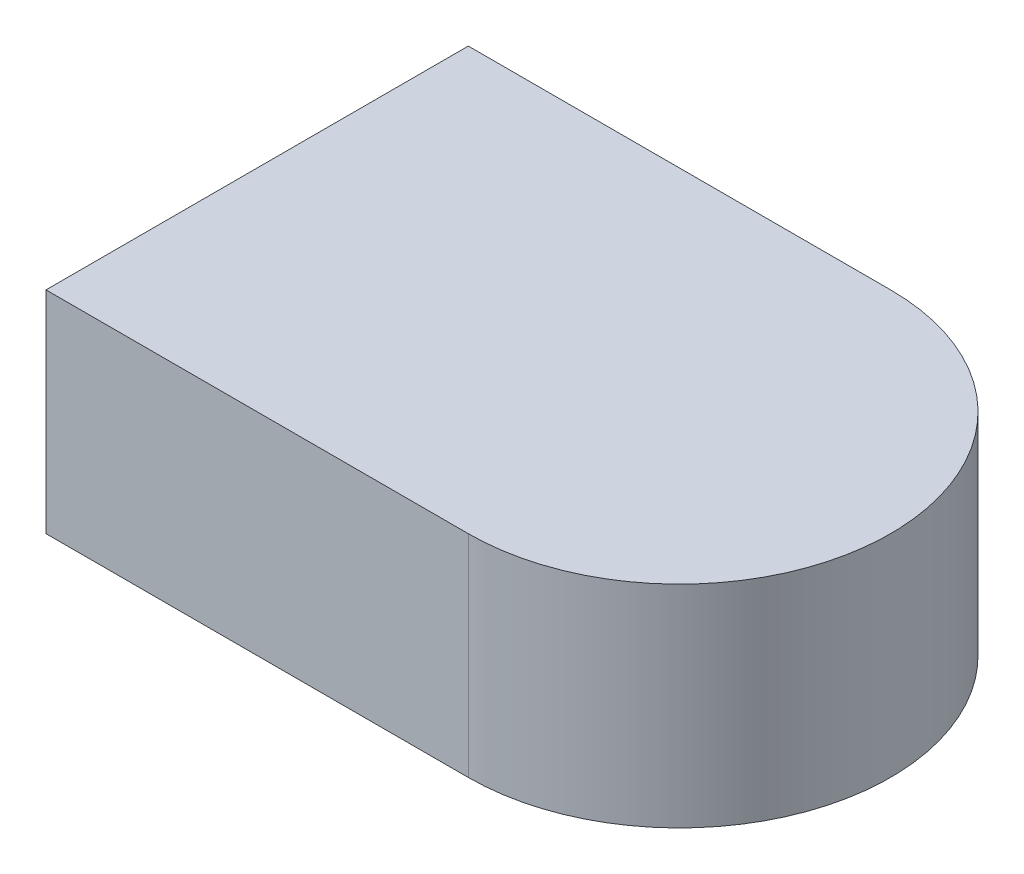
ISO-10303-21;
HEADER;
FILE_DESCRIPTION(('STEP AP214'),'2;1');
FILE_NAME('part.step','',(''),(''),'','','');
FILE_SCHEMA(('AUTOMOTIVE_DESIGN { 1 0 10303 214 1 1 1 1 }'));
ENDSEC;
DATA;
#1=APPLICATION_CONTEXT('core data for automotive mechanical design processes');
#2=APPLICATION_PROTOCOL_DEFINITION('international standard','automotive_design',2000,#1);
#3=PRODUCT_CONTEXT('',#1,'mechanical');
#4=PRODUCT('Part','Part','',(#3));
#5=PRODUCT_RELATED_PRODUCT_CATEGORY('part','',(#4));
#6=PRODUCT_DEFINITION_FORMATION('','',#4);
#7=PRODUCT_DEFINITION_CONTEXT('part definition',#1,'design');
#8=PRODUCT_DEFINITION('design','',#6,#7);
#9=PRODUCT_DEFINITION_SHAPE('','',#8);
#10=(LENGTH_UNIT() NAMED_UNIT(*) SI_UNIT(.MILLI.,.METRE.));
#11=(NAMED_UNIT(*) PLANE_ANGLE_UNIT() SI_UNIT($,.RADIAN.));
#12=(NAMED_UNIT(*) SI_UNIT($,.STERADIAN.) SOLID_ANGLE_UNIT());
#13=UNCERTAINTY_MEASURE_WITH_UNIT(LENGTH_MEASURE(1.E-05),#10,'distance_accuracy_value','');
#14=(GEOMETRIC_REPRESENTATION_CONTEXT(3) GLOBAL_UNCERTAINTY_ASSIGNED_CONTEXT((#13)) GLOBAL_UNIT_ASSIGNED_CONTEXT((#10,
#11,#12)) REPRESENTATION_CONTEXT('',''));
#15=CARTESIAN_POINT('',(0.,0.,0.));
#16=DIRECTION('',(0.,0.,1.));
#17=DIRECTION('',(1.,0.,0.));
#18=AXIS2_PLACEMENT_3D('',#15,#16,#17);
#19=CARTESIAN_POINT('',(0.,0.,0.));
#20=DIRECTION('',(0.,-1.,0.));
#21=DIRECTION('',(-1.,0.,0.));
#22=AXIS2_PLACEMENT_3D('',#19,#20,#21);
#23=PLANE('',#22);
#24=CARTESIAN_POINT('',(-1.05,0.,-0.6));
#25=DIRECTION('',(0.,-1.,0.));
#26=DIRECTION('',(0.,0.,-1.));
#27=AXIS2_PLACEMENT_3D('',#24,#25,#26);
#28=CIRCLE('',#27,0.1);
#29=CARTESIAN_POINT('',(-1.05,0.,-0.7));
#30=VERTEX_POINT('',#29);
#31=CARTESIAN_POINT('',(-1.05,0.,-0.5));
#32=VERTEX_POINT('',#31);
#33=EDGE_CURVE('E11',#30,#32,#28,.T.);
#34=ORIENTED_EDGE('',*,*,#33,.T.);
#35=DIRECTION('',(-1.,0.,0.));
#36=VECTOR('',#35,1.);
#37=CARTESIAN_POINT('',(-1.05,0.,-0.5));
#38=LINE('',#37,#36);
#39=CARTESIAN_POINT('',(-1.25,0.,-0.5));
#40=VERTEX_POINT('',#39);
#41=EDGE_CURVE('E25',#32,#40,#38,.T.);
#42=ORIENTED_EDGE('',*,*,#41,.T.);
#43=DIRECTION('',(0.,0.,-1.));
#44=VECTOR('',#43,1.);
#45=CARTESIAN_POINT('',(-1.25,0.,-0.5));
#46=LINE('',#45,#44);
#47=CARTESIAN_POINT('',(-1.25,0.,-0.7));
#48=VERTEX_POINT('',#47);
#49=EDGE_CURVE('E73',#40,#48,#46,.T.);
#50=ORIENTED_EDGE('',*,*,#49,.T.);
#51=DIRECTION('',(1.,0.,0.));
#52=VECTOR('',#51,1.);
#53=CARTESIAN_POINT('',(-1.25,0.,-0.7));
#54=LINE('',#53,#52);
#55=EDGE_CURVE('E99',#48,#30,#54,.T.);
#56=ORIENTED_EDGE('',*,*,#55,.T.);
#57=EDGE_LOOP('',(#34,#42,#50,#56));
#58=FACE_BOUND('',#57,.T.);
#59=ADVANCED_FACE('F17',(#58),#23,.T.);
#60=CARTESIAN_POINT('',(-1.25,0.,-0.7));
#61=DIRECTION('',(0.,0.,1.));
#62=DIRECTION('',(1.,0.,0.));
#63=AXIS2_PLACEMENT_3D('',#60,#61,#62);
#64=PLANE('',#63);
#65=DIRECTION('',(0.,1.,0.));
#66=VECTOR('',#65,1.);
#67=CARTESIAN_POINT('',(-1.25,0.,-0.7));
#68=LINE('',#67,#66);
#69=CARTESIAN_POINT('',(-1.25,0.1,-0.7));
#70=VERTEX_POINT('',#69);
#71=EDGE_CURVE('E95',#48,#70,#68,.T.);
#72=ORIENTED_EDGE('',*,*,#71,.T.);
#73=DIRECTION('',(1.,0.,0.));
#74=VECTOR('',#73,1.);
#75=CARTESIAN_POINT('',(-1.25,0.1,-0.7));
#76=LINE('',#75,#74);
#77=CARTESIAN_POINT('',(-1.05,0.1,-0.7));
#78=VERTEX_POINT('',#77);
#79=EDGE_CURVE('E68',#70,#78,#76,.T.);
#80=ORIENTED_EDGE('',*,*,#79,.T.);
#81=DIRECTION('',(0.,1.,0.));
#82=VECTOR('',#81,1.);
#83=CARTESIAN_POINT('',(-1.05,0.,-0.7));
#84=LINE('',#83,#82);
#85=EDGE_CURVE('E87',#30,#78,#84,.T.);
#86=ORIENTED_EDGE('',*,*,#85,.F.);
#87=ORIENTED_EDGE('',*,*,#55,.F.);
#88=EDGE_LOOP('',(#72,#80,#86,#87));
#89=FACE_BOUND('',#88,.T.);
#90=ADVANCED_FACE('F113',(#89),#64,.F.);
#91=CARTESIAN_POINT('',(-1.05,0.,-0.6));
#92=DIRECTION('',(0.,-1.,0.));
#93=DIRECTION('',(-1.,0.,0.));
#94=AXIS2_PLACEMENT_3D('',#91,#92,#93);
#95=CYLINDRICAL_SURFACE('',#94,0.1);
#96=ORIENTED_EDGE('',*,*,#85,.T.);
#97=CARTESIAN_POINT('',(-1.05,0.1,-0.6));
#98=DIRECTION('',(0.,-1.,0.));
#99=DIRECTION('',(0.,0.,-1.));
#100=AXIS2_PLACEMENT_3D('',#97,#98,#99);
#101=CIRCLE('',#100,0.1);
#102=CARTESIAN_POINT('',(-1.05,0.1,-0.5));
#103=VERTEX_POINT('',#102);
#104=EDGE_CURVE('E83',#78,#103,#101,.T.);
#105=ORIENTED_EDGE('',*,*,#104,.T.);
#106=DIRECTION('',(0.,1.,0.));
#107=VECTOR('',#106,1.);
#108=CARTESIAN_POINT('',(-1.05,0.,-0.5));
#109=LINE('',#108,#107);
#110=EDGE_CURVE('E60',#32,#103,#109,.T.);
#111=ORIENTED_EDGE('',*,*,#110,.F.);
#112=ORIENTED_EDGE('',*,*,#33,.F.);
#113=EDGE_LOOP('',(#96,#105,#111,#112));
#114=FACE_BOUND('',#113,.T.);
#115=ADVANCED_FACE('F115',(#114),#95,.T.);
#116=CARTESIAN_POINT('',(-1.05,0.,-0.5));
#117=DIRECTION('',(0.,0.,-1.));
#118=DIRECTION('',(-1.,0.,0.));
#119=AXIS2_PLACEMENT_3D('',#116,#117,#118);
#120=PLANE('',#119);
#121=ORIENTED_EDGE('',*,*,#110,.T.);
#122=DIRECTION('',(-1.,0.,0.));
#123=VECTOR('',#122,1.);
#124=CARTESIAN_POINT('',(-1.05,0.1,-0.5));
#125=LINE('',#124,#123);
#126=CARTESIAN_POINT('',(-1.25,0.1,-0.5));
#127=VERTEX_POINT('',#126);
#128=EDGE_CURVE('E53',#103,#127,#125,.T.);
#129=ORIENTED_EDGE('',*,*,#128,.T.);
#130=DIRECTION('',(0.,1.,0.));
#131=VECTOR('',#130,1.);
#132=CARTESIAN_POINT('',(-1.25,0.,-0.5));
#133=LINE('',#132,#131);
#134=EDGE_CURVE('E57',#40,#127,#133,.T.);
#135=ORIENTED_EDGE('',*,*,#134,.F.);
#136=ORIENTED_EDGE('',*,*,#41,.F.);
#137=EDGE_LOOP('',(#121,#129,#135,#136));
#138=FACE_BOUND('',#137,.T.);
#139=ADVANCED_FACE('F55',(#138),#120,.F.);
#140=CARTESIAN_POINT('',(-1.25,0.,-0.5));
#141=DIRECTION('',(1.,0.,0.));
#142=DIRECTION('',(0.,0.,-1.));
#143=AXIS2_PLACEMENT_3D('',#140,#141,#142);
#144=PLANE('',#143);
#145=ORIENTED_EDGE('',*,*,#134,.T.);
#146=DIRECTION('',(0.,0.,-1.));
#147=VECTOR('',#146,1.);
#148=CARTESIAN_POINT('',(-1.25,0.1,-0.5));
#149=LINE('',#148,#147);
#150=EDGE_CURVE('E66',#127,#70,#149,.T.);
#151=ORIENTED_EDGE('',*,*,#150,.T.);
#152=ORIENTED_EDGE('',*,*,#71,.F.);
#153=ORIENTED_EDGE('',*,*,#49,.F.);
#154=EDGE_LOOP('',(#145,#151,#152,#153));
#155=FACE_BOUND('',#154,.T.);
#156=ADVANCED_FACE('F72',(#155),#144,.F.);
#157=CARTESIAN_POINT('',(0.,0.1,0.));
#158=DIRECTION('',(0.,-1.,0.));
#159=DIRECTION('',(-1.,0.,0.));
#160=AXIS2_PLACEMENT_3D('',#157,#158,#159);
#161=PLANE('',#160);
#162=ORIENTED_EDGE('',*,*,#150,.F.);
#163=ORIENTED_EDGE('',*,*,#128,.F.);
#164=ORIENTED_EDGE('',*,*,#104,.F.);
#165=ORIENTED_EDGE('',*,*,#79,.F.);
#166=EDGE_LOOP('',(#162,#163,#164,#165));
#167=FACE_BOUND('',#166,.T.);
#168=ADVANCED_FACE('F67',(#167),#161,.F.);
#169=CLOSED_SHELL('',(#59,#90,#115,#139,#156,#168));
#170=MANIFOLD_SOLID_BREP('B1',#169);
#171=ADVANCED_BREP_SHAPE_REPRESENTATION('',(#18,#170),#14);
#172=SHAPE_DEFINITION_REPRESENTATION(#9,#171);
ENDSEC;
END-ISO-10303-21;
